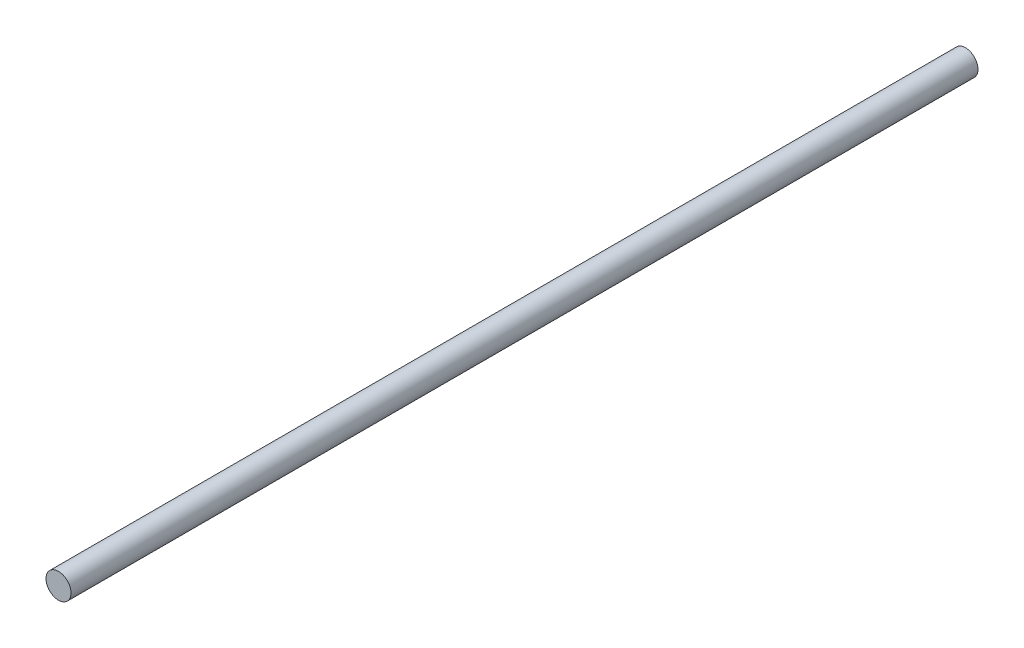
ISO-10303-21;
HEADER;
FILE_DESCRIPTION(('STEP AP214'),'2;1');
FILE_NAME('part.step','',(''),(''),'','','');
FILE_SCHEMA(('AUTOMOTIVE_DESIGN { 1 0 10303 214 1 1 1 1 }'));
ENDSEC;
DATA;
#1=APPLICATION_CONTEXT('core data for automotive mechanical design processes');
#2=APPLICATION_PROTOCOL_DEFINITION('international standard','automotive_design',2000,#1);
#3=PRODUCT_CONTEXT('',#1,'mechanical');
#4=PRODUCT('Part','Part','',(#3));
#5=PRODUCT_RELATED_PRODUCT_CATEGORY('part','',(#4));
#6=PRODUCT_DEFINITION_FORMATION('','',#4);
#7=PRODUCT_DEFINITION_CONTEXT('part definition',#1,'design');
#8=PRODUCT_DEFINITION('design','',#6,#7);
#9=PRODUCT_DEFINITION_SHAPE('','',#8);
#10=(LENGTH_UNIT() NAMED_UNIT(*) SI_UNIT(.MILLI.,.METRE.));
#11=(NAMED_UNIT(*) PLANE_ANGLE_UNIT() SI_UNIT($,.RADIAN.));
#12=(NAMED_UNIT(*) SI_UNIT($,.STERADIAN.) SOLID_ANGLE_UNIT());
#13=UNCERTAINTY_MEASURE_WITH_UNIT(LENGTH_MEASURE(1.E-05),#10,'distance_accuracy_value','');
#14=(GEOMETRIC_REPRESENTATION_CONTEXT(3) GLOBAL_UNCERTAINTY_ASSIGNED_CONTEXT((#13)) GLOBAL_UNIT_ASSIGNED_CONTEXT((#10,
#11,#12)) REPRESENTATION_CONTEXT('',''));
#15=CARTESIAN_POINT('',(0.,0.,0.));
#16=DIRECTION('',(0.,0.,1.));
#17=DIRECTION('',(1.,0.,0.));
#18=AXIS2_PLACEMENT_3D('',#15,#16,#17);
#19=CARTESIAN_POINT('',(0.,0.,145.));
#20=DIRECTION('',(0.,0.,-1.));
#21=DIRECTION('',(-1.,0.,0.));
#22=AXIS2_PLACEMENT_3D('',#19,#20,#21);
#23=CYLINDRICAL_SURFACE('',#22,4.);
#24=CARTESIAN_POINT('',(0.,0.,145.));
#25=DIRECTION('',(0.,0.,1.));
#26=DIRECTION('',(1.,0.,0.));
#27=AXIS2_PLACEMENT_3D('',#24,#25,#26);
#28=CIRCLE('',#27,4.);
#29=CARTESIAN_POINT('',(4.,0.,145.));
#30=VERTEX_POINT('',#29);
#31=EDGE_CURVE('E10',#30,#30,#28,.T.);
#32=ORIENTED_EDGE('',*,*,#31,.F.);
#33=EDGE_LOOP('',(#32));
#34=FACE_BOUND('',#33,.T.);
#35=CARTESIAN_POINT('',(0.,0.,-145.));
#36=DIRECTION('',(0.,0.,1.));
#37=DIRECTION('',(1.,0.,0.));
#38=AXIS2_PLACEMENT_3D('',#35,#36,#37);
#39=CIRCLE('',#38,4.);
#40=CARTESIAN_POINT('',(4.,0.,-145.));
#41=VERTEX_POINT('',#40);
#42=EDGE_CURVE('E34',#41,#41,#39,.T.);
#43=ORIENTED_EDGE('',*,*,#42,.T.);
#44=EDGE_LOOP('',(#43));
#45=FACE_BOUND('',#44,.T.);
#46=ADVANCED_FACE('F31',(#34,#45),#23,.T.);
#47=CARTESIAN_POINT('',(0.,0.,145.));
#48=DIRECTION('',(0.,0.,1.));
#49=DIRECTION('',(1.,0.,0.));
#50=AXIS2_PLACEMENT_3D('',#47,#48,#49);
#51=PLANE('',#50);
#52=ORIENTED_EDGE('',*,*,#31,.T.);
#53=EDGE_LOOP('',(#52));
#54=FACE_BOUND('',#53,.T.);
#55=ADVANCED_FACE('F46',(#54),#51,.T.);
#56=CARTESIAN_POINT('',(0.,0.,-145.));
#57=DIRECTION('',(0.,0.,1.));
#58=DIRECTION('',(1.,0.,0.));
#59=AXIS2_PLACEMENT_3D('',#56,#57,#58);
#60=PLANE('',#59);
#61=ORIENTED_EDGE('',*,*,#42,.F.);
#62=EDGE_LOOP('',(#61));
#63=FACE_BOUND('',#62,.T.);
#64=ADVANCED_FACE('F44',(#63),#60,.F.);
#65=CLOSED_SHELL('',(#46,#55,#64));
#66=MANIFOLD_SOLID_BREP('B2',#65);
#67=ADVANCED_BREP_SHAPE_REPRESENTATION('',(#18,#66),#14);
#68=SHAPE_DEFINITION_REPRESENTATION(#9,#67);
ENDSEC;
END-ISO-10303-21;
